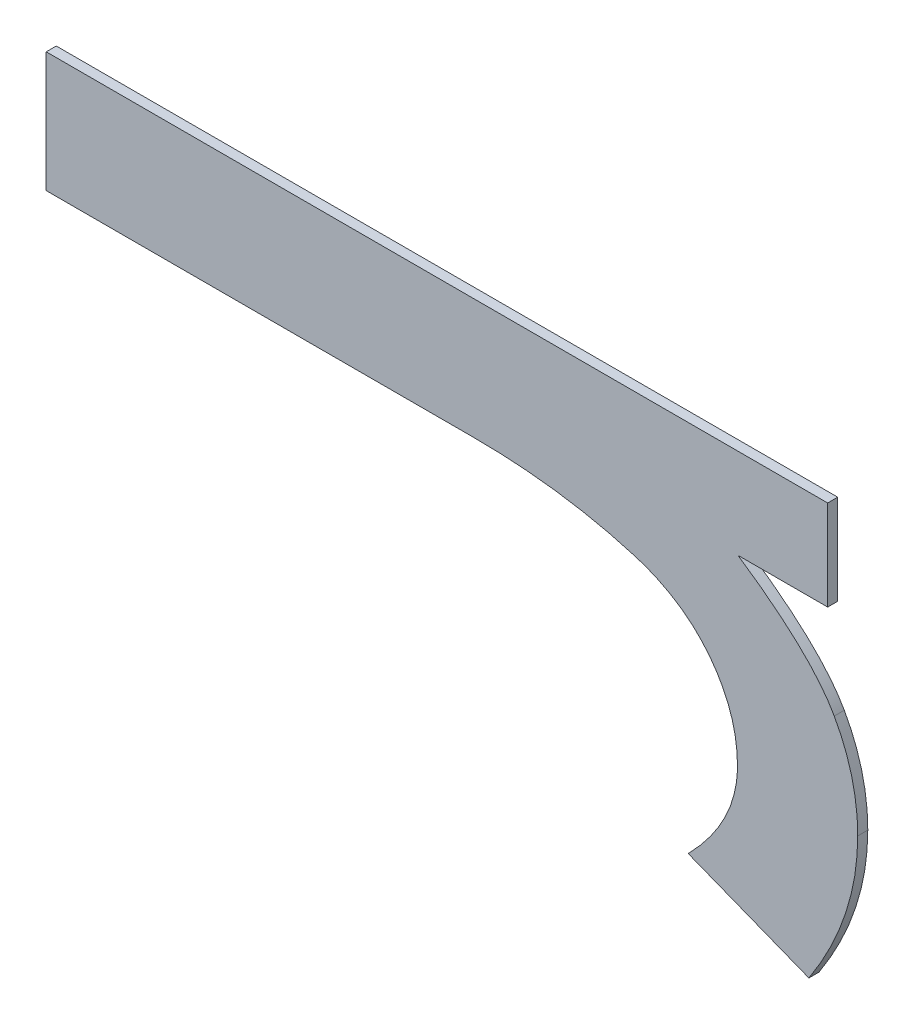
ISO-10303-21;
HEADER;
FILE_DESCRIPTION(('STEP AP214'),'2;1');
FILE_NAME('part.step','',(''),(''),'','','');
FILE_SCHEMA(('AUTOMOTIVE_DESIGN { 1 0 10303 214 1 1 1 1 }'));
ENDSEC;
DATA;
#1=APPLICATION_CONTEXT('core data for automotive mechanical design processes');
#2=APPLICATION_PROTOCOL_DEFINITION('international standard','automotive_design',2000,#1);
#3=PRODUCT_CONTEXT('',#1,'mechanical');
#4=PRODUCT('Part','Part','',(#3));
#5=PRODUCT_RELATED_PRODUCT_CATEGORY('part','',(#4));
#6=PRODUCT_DEFINITION_FORMATION('','',#4);
#7=PRODUCT_DEFINITION_CONTEXT('part definition',#1,'design');
#8=PRODUCT_DEFINITION('design','',#6,#7);
#9=PRODUCT_DEFINITION_SHAPE('','',#8);
#10=(LENGTH_UNIT() NAMED_UNIT(*) SI_UNIT(.MILLI.,.METRE.));
#11=(NAMED_UNIT(*) PLANE_ANGLE_UNIT() SI_UNIT($,.RADIAN.));
#12=(NAMED_UNIT(*) SI_UNIT($,.STERADIAN.) SOLID_ANGLE_UNIT());
#13=UNCERTAINTY_MEASURE_WITH_UNIT(LENGTH_MEASURE(1.E-05),#10,'distance_accuracy_value','');
#14=(GEOMETRIC_REPRESENTATION_CONTEXT(3) GLOBAL_UNCERTAINTY_ASSIGNED_CONTEXT((#13)) GLOBAL_UNIT_ASSIGNED_CONTEXT((#10,
#11,#12)) REPRESENTATION_CONTEXT('',''));
#15=CARTESIAN_POINT('',(0.,0.,0.));
#16=DIRECTION('',(0.,0.,1.));
#17=DIRECTION('',(1.,0.,0.));
#18=AXIS2_PLACEMENT_3D('',#15,#16,#17);
#19=CARTESIAN_POINT('',(1.1006089778178,1.3967464873243,1.7496000059366));
#20=DIRECTION('',(0.,1.,0.));
#21=DIRECTION('',(0.,0.,1.));
#22=AXIS2_PLACEMENT_3D('',#19,#20,#21);
#23=PLANE('',#22);
#24=DIRECTION('',(0.,0.,1.));
#25=VECTOR('',#24,1.);
#26=CARTESIAN_POINT('',(1.0850641795163,1.3967464873243,1.7492000059366));
#27=LINE('',#26,#25);
#28=CARTESIAN_POINT('',(1.0850641795163,1.3967464873243,1.7492000059366));
#29=VERTEX_POINT('',#28);
#30=CARTESIAN_POINT('',(1.0850641795163,1.3967464873243,1.7496000059366));
#31=VERTEX_POINT('',#30);
#32=EDGE_CURVE('E11',#29,#31,#27,.T.);
#33=ORIENTED_EDGE('',*,*,#32,.T.);
#34=DIRECTION('',(1.,0.,0.));
#35=VECTOR('',#34,1.);
#36=CARTESIAN_POINT('',(1.0850641795163,1.3967464873243,1.7496000059366));
#37=LINE('',#36,#35);
#38=CARTESIAN_POINT('',(1.1161537761193,1.3967464873243,1.7496000059366));
#39=VERTEX_POINT('',#38);
#40=EDGE_CURVE('E24',#31,#39,#37,.T.);
#41=ORIENTED_EDGE('',*,*,#40,.T.);
#42=DIRECTION('',(0.,0.,1.));
#43=VECTOR('',#42,1.);
#44=CARTESIAN_POINT('',(1.1161537761193,1.3967464873243,1.7492000059366));
#45=LINE('',#44,#43);
#46=CARTESIAN_POINT('',(1.1161537761193,1.3967464873243,1.7492000059366));
#47=VERTEX_POINT('',#46);
#48=EDGE_CURVE('E281',#47,#39,#45,.T.);
#49=ORIENTED_EDGE('',*,*,#48,.F.);
#50=DIRECTION('',(1.,0.,0.));
#51=VECTOR('',#50,1.);
#52=CARTESIAN_POINT('',(1.0850641795163,1.3967464873243,1.7492000059366));
#53=LINE('',#52,#51);
#54=EDGE_CURVE('E279',#29,#47,#53,.T.);
#55=ORIENTED_EDGE('',*,*,#54,.F.);
#56=EDGE_LOOP('',(#33,#41,#49,#55));
#57=FACE_BOUND('',#56,.T.);
#58=ADVANCED_FACE('F17',(#57),#23,.T.);
#59=CARTESIAN_POINT('',(1.1161537761193,1.394952856751,1.7496000059366));
#60=DIRECTION('',(1.,0.,0.));
#61=DIRECTION('',(0.,0.,-1.));
#62=AXIS2_PLACEMENT_3D('',#59,#60,#61);
#63=PLANE('',#62);
#64=ORIENTED_EDGE('',*,*,#48,.T.);
#65=DIRECTION('',(0.,-1.,0.));
#66=VECTOR('',#65,1.);
#67=CARTESIAN_POINT('',(1.1161537761193,1.3967464873243,1.7496000059366));
#68=LINE('',#67,#66);
#69=CARTESIAN_POINT('',(1.1161537761193,1.3931592261777,1.7496000059366));
#70=VERTEX_POINT('',#69);
#71=EDGE_CURVE('E277',#39,#70,#68,.T.);
#72=ORIENTED_EDGE('',*,*,#71,.T.);
#73=DIRECTION('',(0.,0.,1.));
#74=VECTOR('',#73,1.);
#75=CARTESIAN_POINT('',(1.1161537761193,1.3931592261777,1.7492000059366));
#76=LINE('',#75,#74);
#77=CARTESIAN_POINT('',(1.1161537761193,1.3931592261777,1.7492000059366));
#78=VERTEX_POINT('',#77);
#79=EDGE_CURVE('E274',#78,#70,#76,.T.);
#80=ORIENTED_EDGE('',*,*,#79,.F.);
#81=DIRECTION('',(0.,-1.,0.));
#82=VECTOR('',#81,1.);
#83=CARTESIAN_POINT('',(1.1161537761193,1.3967464873243,1.7492000059366));
#84=LINE('',#83,#82);
#85=EDGE_CURVE('E271',#47,#78,#84,.T.);
#86=ORIENTED_EDGE('',*,*,#85,.F.);
#87=EDGE_LOOP('',(#64,#72,#80,#86));
#88=FACE_BOUND('',#87,.T.);
#89=ADVANCED_FACE('F287',(#88),#63,.T.);
#90=CARTESIAN_POINT('',(1.1143694873719,1.3931592261777,1.7496000059366));
#91=DIRECTION('',(0.,-1.,0.));
#92=DIRECTION('',(0.,0.,-1.));
#93=AXIS2_PLACEMENT_3D('',#90,#91,#92);
#94=PLANE('',#93);
#95=ORIENTED_EDGE('',*,*,#79,.T.);
#96=DIRECTION('',(-1.,0.,0.));
#97=VECTOR('',#96,1.);
#98=CARTESIAN_POINT('',(1.1161537761193,1.3931592261777,1.7496000059366));
#99=LINE('',#98,#97);
#100=CARTESIAN_POINT('',(1.1125851986245,1.3931592261777,1.7496000059366));
#101=VERTEX_POINT('',#100);
#102=EDGE_CURVE('E269',#70,#101,#99,.T.);
#103=ORIENTED_EDGE('',*,*,#102,.T.);
#104=DIRECTION('',(0.,0.,1.));
#105=VECTOR('',#104,1.);
#106=CARTESIAN_POINT('',(1.1125851986245,1.3931592261777,1.7492000059366));
#107=LINE('',#106,#105);
#108=CARTESIAN_POINT('',(1.1125851986245,1.3931592261777,1.7492000059366));
#109=VERTEX_POINT('',#108);
#110=EDGE_CURVE('E266',#109,#101,#107,.T.);
#111=ORIENTED_EDGE('',*,*,#110,.F.);
#112=DIRECTION('',(-1.,0.,0.));
#113=VECTOR('',#112,1.);
#114=CARTESIAN_POINT('',(1.1161537761193,1.3931592261777,1.7492000059366));
#115=LINE('',#114,#113);
#116=EDGE_CURVE('E260',#78,#109,#115,.T.);
#117=ORIENTED_EDGE('',*,*,#116,.F.);
#118=EDGE_LOOP('',(#95,#103,#111,#117));
#119=FACE_BOUND('',#118,.T.);
#120=ADVANCED_FACE('F293',(#119),#94,.T.);
#121=CARTESIAN_POINT('',(1.1125851986245,1.3931592261777,1.7496000059366));
#122=CARTESIAN_POINT('',(1.1125851986245,1.3931592261777,1.7491200059366));
#123=CARTESIAN_POINT('',(1.1154998483061,1.3911974427383,1.7496000059366));
#124=CARTESIAN_POINT('',(1.1154998483061,1.3911974427383,1.7491200059366));
#125=CARTESIAN_POINT('',(1.1164153472445,1.3895345977277,1.7496000059366));
#126=CARTESIAN_POINT('',(1.1164153472445,1.3895345977277,1.7491200059366));
#127=B_SPLINE_SURFACE_WITH_KNOTS('',2,1,((#121,#122),(#123,#124),(#125,#126)),.UNSPECIFIED.,.F.,
.F.,.F.,(3,3),(2,2),(0.,1.),(0.,0.000239999999999974),.UNSPECIFIED.);
#128=CARTESIAN_POINT('',(1.1125851986245,1.3931592261777,1.7496000059366));
#129=CARTESIAN_POINT('',(1.1154998483061,1.3911974427383,1.7496000059366));
#130=CARTESIAN_POINT('',(1.1164153472445,1.3895345977277,1.7496000059366));
#131=B_SPLINE_CURVE_WITH_KNOTS('',2,(#128,#129,#130),.UNSPECIFIED.,.F.,.F.,(3,3),(0.,1.),.UNSPECIFIED.);
#132=CARTESIAN_POINT('',(1.1164153472445,1.3895345977277,1.7496000059366));
#133=VERTEX_POINT('',#132);
#134=EDGE_CURVE('E256',#101,#133,#131,.T.);
#135=DIRECTION('',(0.,0.,1.));
#136=VECTOR('',#135,1.);
#137=CARTESIAN_POINT('',(1.1164153472445,1.3895345977277,1.7492000059366));
#138=LINE('',#137,#136);
#139=CARTESIAN_POINT('',(1.1164153472445,1.3895345977277,1.7492000059366));
#140=VERTEX_POINT('',#139);
#141=EDGE_CURVE('E250',#140,#133,#138,.T.);
#142=CARTESIAN_POINT('',(1.1125851986245,1.3931592261777,1.7492000059366));
#143=CARTESIAN_POINT('',(1.1154998483061,1.3911974427383,1.7492000059366));
#144=CARTESIAN_POINT('',(1.1164153472445,1.3895345977277,1.7492000059366));
#145=B_SPLINE_CURVE_WITH_KNOTS('',2,(#142,#143,#144),.UNSPECIFIED.,.F.,.F.,(3,3),(0.,1.),.UNSPECIFIED.);
#146=EDGE_CURVE('E242',#109,#140,#145,.T.);
#147=ORIENTED_EDGE('',*,*,#110,.T.);
#148=ORIENTED_EDGE('',*,*,#134,.T.);
#149=ORIENTED_EDGE('',*,*,#141,.F.);
#150=ORIENTED_EDGE('',*,*,#146,.F.);
#151=EDGE_LOOP('',(#147,#148,#149,#150));
#152=FACE_BOUND('',#151,.T.);
#153=ADVANCED_FACE('F297',(#152),#127,.T.);
#154=CARTESIAN_POINT('',(1.1164153472445,1.3895345977277,1.7496000059366));
#155=CARTESIAN_POINT('',(1.1164153472445,1.3895345977277,1.7491200059366));
#156=CARTESIAN_POINT('',(1.1173495298347,1.3878717527171,1.7496000059366));
#157=CARTESIAN_POINT('',(1.1173495298347,1.3878717527171,1.7491200059366));
#158=CARTESIAN_POINT('',(1.1173495298347,1.3858726019739,1.7496000059366));
#159=CARTESIAN_POINT('',(1.1173495298347,1.3858726019739,1.7491200059366));
#160=B_SPLINE_SURFACE_WITH_KNOTS('',2,1,((#154,#155),(#156,#157),(#158,#159)),.UNSPECIFIED.,.F.,
.F.,.F.,(3,3),(2,2),(0.,1.),(0.,0.000239999999999974),.UNSPECIFIED.);
#161=CARTESIAN_POINT('',(1.1164153472445,1.3895345977277,1.7496000059366));
#162=CARTESIAN_POINT('',(1.1173495298347,1.3878717527171,1.7496000059366));
#163=CARTESIAN_POINT('',(1.1173495298347,1.3858726019739,1.7496000059366));
#164=B_SPLINE_CURVE_WITH_KNOTS('',2,(#161,#162,#163),.UNSPECIFIED.,.F.,.F.,(3,3),(0.,1.),.UNSPECIFIED.);
#165=CARTESIAN_POINT('',(1.1173495298347,1.3858726019739,1.7496000059366));
#166=VERTEX_POINT('',#165);
#167=EDGE_CURVE('E238',#133,#166,#164,.T.);
#168=DIRECTION('',(0.,0.,1.));
#169=VECTOR('',#168,1.);
#170=CARTESIAN_POINT('',(1.1173495298347,1.3858726019739,1.7492000059366));
#171=LINE('',#170,#169);
#172=CARTESIAN_POINT('',(1.1173495298347,1.3858726019739,1.7492000059366));
#173=VERTEX_POINT('',#172);
#174=EDGE_CURVE('E232',#173,#166,#171,.T.);
#175=CARTESIAN_POINT('',(1.1164153472445,1.3895345977277,1.7492000059366));
#176=CARTESIAN_POINT('',(1.1173495298347,1.3878717527171,1.7492000059366));
#177=CARTESIAN_POINT('',(1.1173495298347,1.3858726019739,1.7492000059366));
#178=B_SPLINE_CURVE_WITH_KNOTS('',2,(#175,#176,#177),.UNSPECIFIED.,.F.,.F.,(3,3),(0.,1.),.UNSPECIFIED.);
#179=EDGE_CURVE('E224',#140,#173,#178,.T.);
#180=ORIENTED_EDGE('',*,*,#141,.T.);
#181=ORIENTED_EDGE('',*,*,#167,.T.);
#182=ORIENTED_EDGE('',*,*,#174,.F.);
#183=ORIENTED_EDGE('',*,*,#179,.F.);
#184=EDGE_LOOP('',(#180,#181,#182,#183));
#185=FACE_BOUND('',#184,.T.);
#186=ADVANCED_FACE('F301',(#185),#160,.T.);
#187=CARTESIAN_POINT('',(1.1173495298347,1.3858726019739,1.7496000059366));
#188=CARTESIAN_POINT('',(1.1173495298347,1.3858726019739,1.7491200059366));
#189=CARTESIAN_POINT('',(1.1173495298347,1.3829766359443,1.7496000059366));
#190=CARTESIAN_POINT('',(1.1173495298347,1.3829766359443,1.7491200059366));
#191=CARTESIAN_POINT('',(1.1154064300471,1.3800059353073,1.7496000059366));
#192=CARTESIAN_POINT('',(1.1154064300471,1.3800059353073,1.7491200059366));
#193=B_SPLINE_SURFACE_WITH_KNOTS('',2,1,((#187,#188),(#189,#190),(#191,#192)),.UNSPECIFIED.,.F.,
.F.,.F.,(3,3),(2,2),(0.,1.),(0.,0.000239999999999974),.UNSPECIFIED.);
#194=CARTESIAN_POINT('',(1.1173495298347,1.3858726019739,1.7496000059366));
#195=CARTESIAN_POINT('',(1.1173495298347,1.3829766359443,1.7496000059366));
#196=CARTESIAN_POINT('',(1.1154064300471,1.3800059353073,1.7496000059366));
#197=B_SPLINE_CURVE_WITH_KNOTS('',2,(#194,#195,#196),.UNSPECIFIED.,.F.,.F.,(3,3),(0.,1.),.UNSPECIFIED.);
#198=CARTESIAN_POINT('',(1.1154064300471,1.3800059353073,1.7496000059366));
#199=VERTEX_POINT('',#198);
#200=EDGE_CURVE('E220',#166,#199,#197,.T.);
#201=DIRECTION('',(0.,0.,1.));
#202=VECTOR('',#201,1.);
#203=CARTESIAN_POINT('',(1.1154064300471,1.3800059353073,1.7492000059366));
#204=LINE('',#203,#202);
#205=CARTESIAN_POINT('',(1.1154064300471,1.3800059353073,1.7492000059366));
#206=VERTEX_POINT('',#205);
#207=EDGE_CURVE('E214',#206,#199,#204,.T.);
#208=CARTESIAN_POINT('',(1.1173495298347,1.3858726019739,1.7492000059366));
#209=CARTESIAN_POINT('',(1.1173495298347,1.3829766359443,1.7492000059366));
#210=CARTESIAN_POINT('',(1.1154064300471,1.3800059353073,1.7492000059366));
#211=B_SPLINE_CURVE_WITH_KNOTS('',2,(#208,#209,#210),.UNSPECIFIED.,.F.,.F.,(3,3),(0.,1.),.UNSPECIFIED.);
#212=EDGE_CURVE('E209',#173,#206,#211,.T.);
#213=ORIENTED_EDGE('',*,*,#174,.T.);
#214=ORIENTED_EDGE('',*,*,#200,.T.);
#215=ORIENTED_EDGE('',*,*,#207,.F.);
#216=ORIENTED_EDGE('',*,*,#212,.F.);
#217=EDGE_LOOP('',(#213,#214,#215,#216));
#218=FACE_BOUND('',#217,.T.);
#219=ADVANCED_FACE('F304',(#218),#193,.T.);
#220=CARTESIAN_POINT('',(1.1130055807902,1.3809494597234,1.7496000059366));
#221=DIRECTION('',(-0.365764413999754,-0.930707469321815,0.));
#222=DIRECTION('',(0.,0.,-1.));
#223=AXIS2_PLACEMENT_3D('',#220,#221,#222);
#224=PLANE('',#223);
#225=ORIENTED_EDGE('',*,*,#207,.T.);
#226=DIRECTION('',(-0.930707469321815,0.365764413999754,0.));
#227=VECTOR('',#226,1.);
#228=CARTESIAN_POINT('',(1.1154064300471,1.3800059353073,1.7496000059366));
#229=LINE('',#228,#227);
#230=CARTESIAN_POINT('',(1.1106047315333,1.3818929841395,1.7496000059366));
#231=VERTEX_POINT('',#230);
#232=EDGE_CURVE('E207',#199,#231,#229,.T.);
#233=ORIENTED_EDGE('',*,*,#232,.T.);
#234=DIRECTION('',(0.,0.,1.));
#235=VECTOR('',#234,1.);
#236=CARTESIAN_POINT('',(1.1106047315333,1.3818929841395,1.7492000059366));
#237=LINE('',#236,#235);
#238=CARTESIAN_POINT('',(1.1106047315333,1.3818929841395,1.7492000059366));
#239=VERTEX_POINT('',#238);
#240=EDGE_CURVE('E204',#239,#231,#237,.T.);
#241=ORIENTED_EDGE('',*,*,#240,.F.);
#242=DIRECTION('',(-0.930707469321815,0.365764413999754,0.));
#243=VECTOR('',#242,1.);
#244=CARTESIAN_POINT('',(1.1154064300471,1.3800059353073,1.7492000059366));
#245=LINE('',#244,#243);
#246=EDGE_CURVE('E198',#206,#239,#245,.T.);
#247=ORIENTED_EDGE('',*,*,#246,.F.);
#248=EDGE_LOOP('',(#225,#233,#241,#247));
#249=FACE_BOUND('',#248,.T.);
#250=ADVANCED_FACE('F309',(#249),#224,.T.);
#251=CARTESIAN_POINT('',(1.1106047315333,1.3818929841395,1.7496000059366));
#252=CARTESIAN_POINT('',(1.1106047315333,1.3818929841395,1.7491200059366));
#253=CARTESIAN_POINT('',(1.1125665149727,1.3838921348827,1.7496000059366));
#254=CARTESIAN_POINT('',(1.1125665149727,1.3838921348827,1.7491200059366));
#255=CARTESIAN_POINT('',(1.1125665149727,1.3858912856257,1.7496000059366));
#256=CARTESIAN_POINT('',(1.1125665149727,1.3858912856257,1.7491200059366));
#257=B_SPLINE_SURFACE_WITH_KNOTS('',2,1,((#251,#252),(#253,#254),(#255,#256)),.UNSPECIFIED.,.F.,
.F.,.F.,(3,3),(2,2),(0.,1.),(0.,0.000239999999999974),.UNSPECIFIED.);
#258=CARTESIAN_POINT('',(1.1106047315333,1.3818929841395,1.7496000059366));
#259=CARTESIAN_POINT('',(1.1125665149727,1.3838921348827,1.7496000059366));
#260=CARTESIAN_POINT('',(1.1125665149727,1.3858912856257,1.7496000059366));
#261=B_SPLINE_CURVE_WITH_KNOTS('',2,(#258,#259,#260),.UNSPECIFIED.,.F.,.F.,(3,3),(0.,1.),.UNSPECIFIED.);
#262=CARTESIAN_POINT('',(1.1125665149727,1.3858912856257,1.7496000059366));
#263=VERTEX_POINT('',#262);
#264=EDGE_CURVE('E194',#231,#263,#261,.T.);
#265=DIRECTION('',(0.,0.,1.));
#266=VECTOR('',#265,1.);
#267=CARTESIAN_POINT('',(1.1125665149727,1.3858912856257,1.7492000059366));
#268=LINE('',#267,#266);
#269=CARTESIAN_POINT('',(1.1125665149727,1.3858912856257,1.7492000059366));
#270=VERTEX_POINT('',#269);
#271=EDGE_CURVE('E188',#270,#263,#268,.T.);
#272=CARTESIAN_POINT('',(1.1106047315333,1.3818929841395,1.7492000059366));
#273=CARTESIAN_POINT('',(1.1125665149727,1.3838921348827,1.7492000059366));
#274=CARTESIAN_POINT('',(1.1125665149727,1.3858912856257,1.7492000059366));
#275=B_SPLINE_CURVE_WITH_KNOTS('',2,(#272,#273,#274),.UNSPECIFIED.,.F.,.F.,(3,3),(0.,1.),.UNSPECIFIED.);
#276=EDGE_CURVE('E180',#239,#270,#275,.T.);
#277=ORIENTED_EDGE('',*,*,#240,.T.);
#278=ORIENTED_EDGE('',*,*,#264,.T.);
#279=ORIENTED_EDGE('',*,*,#271,.F.);
#280=ORIENTED_EDGE('',*,*,#276,.F.);
#281=EDGE_LOOP('',(#277,#278,#279,#280));
#282=FACE_BOUND('',#281,.T.);
#283=ADVANCED_FACE('F313',(#282),#257,.T.);
#284=CARTESIAN_POINT('',(1.1125665149727,1.3858912856257,1.7496000059366));
#285=CARTESIAN_POINT('',(1.1125665149727,1.3858912856257,1.7491200059366));
#286=CARTESIAN_POINT('',(1.1125665149727,1.3876662325471,1.7496000059366));
#287=CARTESIAN_POINT('',(1.1125665149727,1.3876662325471,1.7491200059366));
#288=CARTESIAN_POINT('',(1.1114828631681,1.3890861900843,1.7496000059366));
#289=CARTESIAN_POINT('',(1.1114828631681,1.3890861900843,1.7491200059366));
#290=B_SPLINE_SURFACE_WITH_KNOTS('',2,1,((#284,#285),(#286,#287),(#288,#289)),.UNSPECIFIED.,.F.,
.F.,.F.,(3,3),(2,2),(0.,1.),(0.,0.000239999999999974),.UNSPECIFIED.);
#291=CARTESIAN_POINT('',(1.1125665149727,1.3858912856257,1.7496000059366));
#292=CARTESIAN_POINT('',(1.1125665149727,1.3876662325471,1.7496000059366));
#293=CARTESIAN_POINT('',(1.1114828631681,1.3890861900843,1.7496000059366));
#294=B_SPLINE_CURVE_WITH_KNOTS('',2,(#291,#292,#293),.UNSPECIFIED.,.F.,.F.,(3,3),(0.,1.),.UNSPECIFIED.);
#295=CARTESIAN_POINT('',(1.1114828631681,1.3890861900843,1.7496000059366));
#296=VERTEX_POINT('',#295);
#297=EDGE_CURVE('E176',#263,#296,#294,.T.);
#298=DIRECTION('',(0.,0.,1.));
#299=VECTOR('',#298,1.);
#300=CARTESIAN_POINT('',(1.1114828631681,1.3890861900843,1.7492000059366));
#301=LINE('',#300,#299);
#302=CARTESIAN_POINT('',(1.1114828631681,1.3890861900843,1.7492000059366));
#303=VERTEX_POINT('',#302);
#304=EDGE_CURVE('E170',#303,#296,#301,.T.);
#305=CARTESIAN_POINT('',(1.1125665149727,1.3858912856257,1.7492000059366));
#306=CARTESIAN_POINT('',(1.1125665149727,1.3876662325471,1.7492000059366));
#307=CARTESIAN_POINT('',(1.1114828631681,1.3890861900843,1.7492000059366));
#308=B_SPLINE_CURVE_WITH_KNOTS('',2,(#305,#306,#307),.UNSPECIFIED.,.F.,.F.,(3,3),(0.,1.),.UNSPECIFIED.);
#309=EDGE_CURVE('E162',#270,#303,#308,.T.);
#310=ORIENTED_EDGE('',*,*,#271,.T.);
#311=ORIENTED_EDGE('',*,*,#297,.T.);
#312=ORIENTED_EDGE('',*,*,#304,.F.);
#313=ORIENTED_EDGE('',*,*,#309,.F.);
#314=EDGE_LOOP('',(#310,#311,#312,#313));
#315=FACE_BOUND('',#314,.T.);
#316=ADVANCED_FACE('F317',(#315),#290,.T.);
#317=CARTESIAN_POINT('',(1.1114828631681,1.3890861900843,1.7496000059366));
#318=CARTESIAN_POINT('',(1.1114828631681,1.3890861900843,1.7491200059366));
#319=CARTESIAN_POINT('',(1.1103992113635,1.3905061476215,1.7496000059366));
#320=CARTESIAN_POINT('',(1.1103992113635,1.3905061476215,1.7491200059366));
#321=CARTESIAN_POINT('',(1.1084747952275,1.3910853408275,1.7496000059366));
#322=CARTESIAN_POINT('',(1.1084747952275,1.3910853408275,1.7491200059366));
#323=B_SPLINE_SURFACE_WITH_KNOTS('',2,1,((#317,#318),(#319,#320),(#321,#322)),.UNSPECIFIED.,.F.,
.F.,.F.,(3,3),(2,2),(0.,1.),(0.,0.000239999999999974),.UNSPECIFIED.);
#324=CARTESIAN_POINT('',(1.1114828631681,1.3890861900843,1.7496000059366));
#325=CARTESIAN_POINT('',(1.1103992113635,1.3905061476215,1.7496000059366));
#326=CARTESIAN_POINT('',(1.1084747952275,1.3910853408275,1.7496000059366));
#327=B_SPLINE_CURVE_WITH_KNOTS('',2,(#324,#325,#326),.UNSPECIFIED.,.F.,.F.,(3,3),(0.,1.),.UNSPECIFIED.);
#328=CARTESIAN_POINT('',(1.1084747952275,1.3910853408275,1.7496000059366));
#329=VERTEX_POINT('',#328);
#330=EDGE_CURVE('E158',#296,#329,#327,.T.);
#331=DIRECTION('',(0.,0.,1.));
#332=VECTOR('',#331,1.);
#333=CARTESIAN_POINT('',(1.1084747952275,1.3910853408275,1.7492000059366));
#334=LINE('',#333,#332);
#335=CARTESIAN_POINT('',(1.1084747952275,1.3910853408275,1.7492000059366));
#336=VERTEX_POINT('',#335);
#337=EDGE_CURVE('E152',#336,#329,#334,.T.);
#338=CARTESIAN_POINT('',(1.1114828631681,1.3890861900843,1.7492000059366));
#339=CARTESIAN_POINT('',(1.1103992113635,1.3905061476215,1.7492000059366));
#340=CARTESIAN_POINT('',(1.1084747952275,1.3910853408275,1.7492000059366));
#341=B_SPLINE_CURVE_WITH_KNOTS('',2,(#338,#339,#340),.UNSPECIFIED.,.F.,.F.,(3,3),(0.,1.),.UNSPECIFIED.);
#342=EDGE_CURVE('E145',#303,#336,#341,.T.);
#343=ORIENTED_EDGE('',*,*,#304,.T.);
#344=ORIENTED_EDGE('',*,*,#330,.T.);
#345=ORIENTED_EDGE('',*,*,#337,.F.);
#346=ORIENTED_EDGE('',*,*,#342,.F.);
#347=EDGE_LOOP('',(#343,#344,#345,#346));
#348=FACE_BOUND('',#347,.T.);
#349=ADVANCED_FACE('F320',(#348),#323,.T.);
#350=CARTESIAN_POINT('',(1.1084747952275,1.3910853408275,1.7496000059366));
#351=CARTESIAN_POINT('',(1.1084747952275,1.3910853408275,1.7491200059366));
#352=CARTESIAN_POINT('',(1.1055414618943,1.3919634724623,1.7496000059366));
#353=CARTESIAN_POINT('',(1.1055414618943,1.3919634724623,1.7491200059366));
#354=CARTESIAN_POINT('',(1.1020476190067,1.3919634724623,1.7496000059366));
#355=CARTESIAN_POINT('',(1.1020476190067,1.3919634724623,1.7491200059366));
#356=B_SPLINE_SURFACE_WITH_KNOTS('',2,1,((#350,#351),(#352,#353),(#354,#355)),.UNSPECIFIED.,.F.,
.F.,.F.,(3,3),(2,2),(0.,1.),(0.,0.000239999999999974),.UNSPECIFIED.);
#357=CARTESIAN_POINT('',(1.1084747952275,1.3910853408275,1.7496000059366));
#358=CARTESIAN_POINT('',(1.1055414618943,1.3919634724623,1.7496000059366));
#359=CARTESIAN_POINT('',(1.1020476190067,1.3919634724623,1.7496000059366));
#360=B_SPLINE_CURVE_WITH_KNOTS('',2,(#357,#358,#359),.UNSPECIFIED.,.F.,.F.,(3,3),(0.,1.),.UNSPECIFIED.);
#361=CARTESIAN_POINT('',(1.1020476190067,1.3919634724623,1.7496000059366));
#362=VERTEX_POINT('',#361);
#363=EDGE_CURVE('E141',#329,#362,#360,.T.);
#364=DIRECTION('',(0.,0.,1.));
#365=VECTOR('',#364,1.);
#366=CARTESIAN_POINT('',(1.1020476190067,1.3919634724623,1.7492000059366));
#367=LINE('',#366,#365);
#368=CARTESIAN_POINT('',(1.1020476190067,1.3919634724623,1.7492000059366));
#369=VERTEX_POINT('',#368);
#370=EDGE_CURVE('E136',#369,#362,#367,.T.);
#371=CARTESIAN_POINT('',(1.1084747952275,1.3910853408275,1.7492000059366));
#372=CARTESIAN_POINT('',(1.1055414618943,1.3919634724623,1.7492000059366));
#373=CARTESIAN_POINT('',(1.1020476190067,1.3919634724623,1.7492000059366));
#374=B_SPLINE_CURVE_WITH_KNOTS('',2,(#371,#372,#373),.UNSPECIFIED.,.F.,.F.,(3,3),(0.,1.),.UNSPECIFIED.);
#375=EDGE_CURVE('E125',#336,#369,#374,.T.);
#376=ORIENTED_EDGE('',*,*,#337,.T.);
#377=ORIENTED_EDGE('',*,*,#363,.T.);
#378=ORIENTED_EDGE('',*,*,#370,.F.);
#379=ORIENTED_EDGE('',*,*,#375,.F.);
#380=EDGE_LOOP('',(#376,#377,#378,#379));
#381=FACE_BOUND('',#380,.T.);
#382=ADVANCED_FACE('F323',(#381),#356,.T.);
#383=CARTESIAN_POINT('',(1.0935558992615,1.3919634724623,1.7496000059366));
#384=DIRECTION('',(0.,-1.,0.));
#385=DIRECTION('',(0.,0.,-1.));
#386=AXIS2_PLACEMENT_3D('',#383,#384,#385);
#387=PLANE('',#386);
#388=ORIENTED_EDGE('',*,*,#370,.T.);
#389=DIRECTION('',(-1.,0.,0.));
#390=VECTOR('',#389,1.);
#391=CARTESIAN_POINT('',(1.1020476190067,1.3919634724623,1.7496000059366));
#392=LINE('',#391,#390);
#393=CARTESIAN_POINT('',(1.0850641795163,1.3919634724623,1.7496000059366));
#394=VERTEX_POINT('',#393);
#395=EDGE_CURVE('E114',#362,#394,#392,.T.);
#396=ORIENTED_EDGE('',*,*,#395,.T.);
#397=DIRECTION('',(0.,0.,1.));
#398=VECTOR('',#397,1.);
#399=CARTESIAN_POINT('',(1.0850641795163,1.3919634724623,1.7492000059366));
#400=LINE('',#399,#398);
#401=CARTESIAN_POINT('',(1.0850641795163,1.3919634724623,1.7492000059366));
#402=VERTEX_POINT('',#401);
#403=EDGE_CURVE('E108',#402,#394,#400,.T.);
#404=ORIENTED_EDGE('',*,*,#403,.F.);
#405=DIRECTION('',(-1.,0.,0.));
#406=VECTOR('',#405,1.);
#407=CARTESIAN_POINT('',(1.1020476190067,1.3919634724623,1.7492000059366));
#408=LINE('',#407,#406);
#409=EDGE_CURVE('E112',#369,#402,#408,.T.);
#410=ORIENTED_EDGE('',*,*,#409,.F.);
#411=EDGE_LOOP('',(#388,#396,#404,#410));
#412=FACE_BOUND('',#411,.T.);
#413=ADVANCED_FACE('F111',(#412),#387,.T.);
#414=CARTESIAN_POINT('',(1.0850641795163,1.3943549798933,1.7496000059366));
#415=DIRECTION('',(-1.,0.,0.));
#416=DIRECTION('',(0.,0.,1.));
#417=AXIS2_PLACEMENT_3D('',#414,#415,#416);
#418=PLANE('',#417);
#419=ORIENTED_EDGE('',*,*,#403,.T.);
#420=DIRECTION('',(0.,1.,0.));
#421=VECTOR('',#420,1.);
#422=CARTESIAN_POINT('',(1.0850641795163,1.3919634724623,1.7496000059366));
#423=LINE('',#422,#421);
#424=EDGE_CURVE('E126',#394,#31,#423,.T.);
#425=ORIENTED_EDGE('',*,*,#424,.T.);
#426=ORIENTED_EDGE('',*,*,#32,.F.);
#427=DIRECTION('',(0.,1.,0.));
#428=VECTOR('',#427,1.);
#429=CARTESIAN_POINT('',(1.0850641795163,1.3919634724623,1.7492000059366));
#430=LINE('',#429,#428);
#431=EDGE_CURVE('E122',#402,#29,#430,.T.);
#432=ORIENTED_EDGE('',*,*,#431,.F.);
#433=EDGE_LOOP('',(#419,#425,#426,#432));
#434=FACE_BOUND('',#433,.T.);
#435=ADVANCED_FACE('F128',(#434),#418,.T.);
#436=CARTESIAN_POINT('',(1.0850641795163,1.3883762113158,1.7492000059366));
#437=DIRECTION('',(0.,0.,-1.));
#438=DIRECTION('',(-1.,0.,0.));
#439=AXIS2_PLACEMENT_3D('',#436,#437,#438);
#440=PLANE('',#439);
#441=ORIENTED_EDGE('',*,*,#54,.T.);
#442=ORIENTED_EDGE('',*,*,#85,.T.);
#443=ORIENTED_EDGE('',*,*,#116,.T.);
#444=ORIENTED_EDGE('',*,*,#146,.T.);
#445=ORIENTED_EDGE('',*,*,#179,.T.);
#446=ORIENTED_EDGE('',*,*,#212,.T.);
#447=ORIENTED_EDGE('',*,*,#246,.T.);
#448=ORIENTED_EDGE('',*,*,#276,.T.);
#449=ORIENTED_EDGE('',*,*,#309,.T.);
#450=ORIENTED_EDGE('',*,*,#342,.T.);
#451=ORIENTED_EDGE('',*,*,#375,.T.);
#452=ORIENTED_EDGE('',*,*,#409,.T.);
#453=ORIENTED_EDGE('',*,*,#431,.T.);
#454=EDGE_LOOP('',(#441,#442,#443,#444,#445,#446,#447,#448,#449,#450,#451,#452,#453));
#455=FACE_BOUND('',#454,.T.);
#456=ADVANCED_FACE('F121',(#455),#440,.T.);
#457=CARTESIAN_POINT('',(1.0850641795163,1.3883762113158,1.7496000059366));
#458=DIRECTION('',(0.,0.,-1.));
#459=DIRECTION('',(-1.,0.,0.));
#460=AXIS2_PLACEMENT_3D('',#457,#458,#459);
#461=PLANE('',#460);
#462=ORIENTED_EDGE('',*,*,#40,.F.);
#463=ORIENTED_EDGE('',*,*,#424,.F.);
#464=ORIENTED_EDGE('',*,*,#395,.F.);
#465=ORIENTED_EDGE('',*,*,#363,.F.);
#466=ORIENTED_EDGE('',*,*,#330,.F.);
#467=ORIENTED_EDGE('',*,*,#297,.F.);
#468=ORIENTED_EDGE('',*,*,#264,.F.);
#469=ORIENTED_EDGE('',*,*,#232,.F.);
#470=ORIENTED_EDGE('',*,*,#200,.F.);
#471=ORIENTED_EDGE('',*,*,#167,.F.);
#472=ORIENTED_EDGE('',*,*,#134,.F.);
#473=ORIENTED_EDGE('',*,*,#102,.F.);
#474=ORIENTED_EDGE('',*,*,#71,.F.);
#475=EDGE_LOOP('',(#462,#463,#464,#465,#466,#467,#468,#469,#470,#471,#472,#473,#474));
#476=FACE_BOUND('',#475,.T.);
#477=ADVANCED_FACE('F289',(#476),#461,.F.);
#478=CLOSED_SHELL('',(#58,#89,#120,#153,#186,#219,#250,#283,#316,#349,#382,#413,#435,#456,#477));
#479=MANIFOLD_SOLID_BREP('B1',#478);
#480=ADVANCED_BREP_SHAPE_REPRESENTATION('',(#18,#479),#14);
#481=SHAPE_DEFINITION_REPRESENTATION(#9,#480);
ENDSEC;
END-ISO-10303-21;
